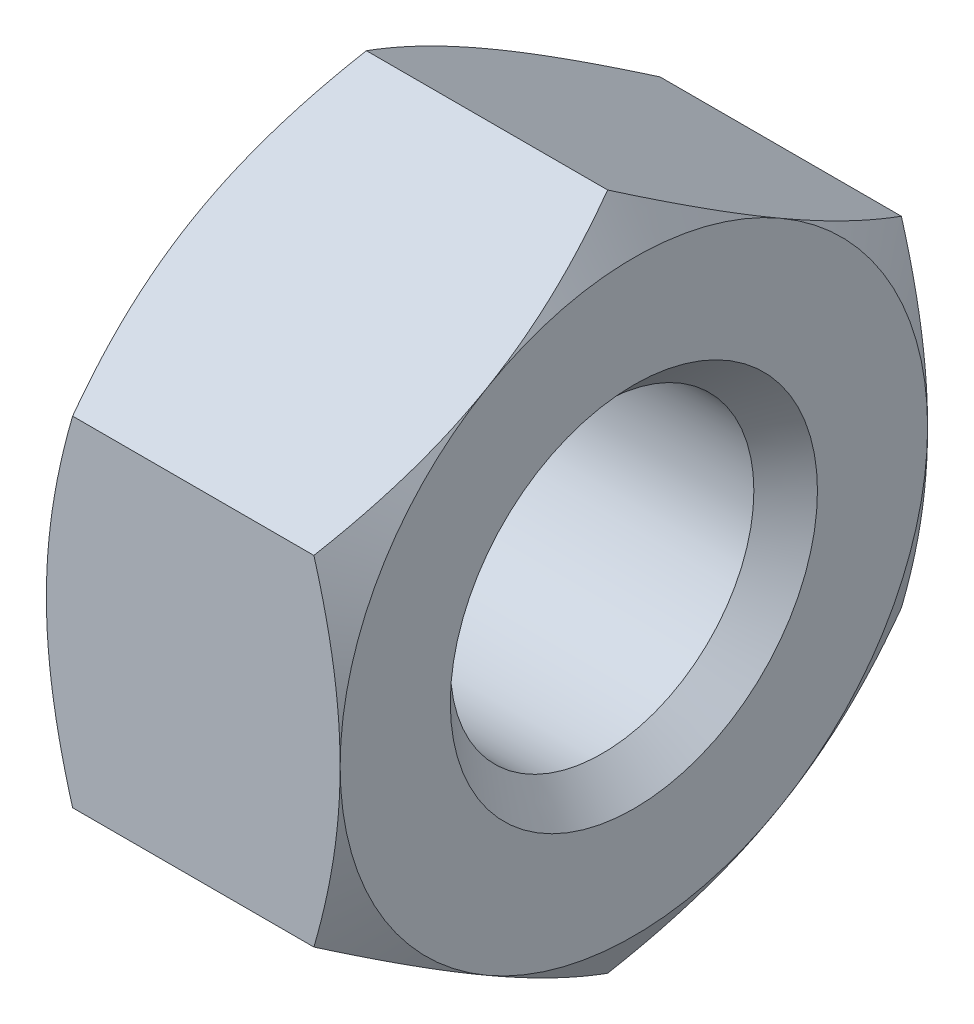
ISO-10303-21;
HEADER;
FILE_DESCRIPTION(('STEP AP214'),'2;1');
FILE_NAME('part.step','',(''),(''),'','','');
FILE_SCHEMA(('AUTOMOTIVE_DESIGN { 1 0 10303 214 1 1 1 1 }'));
ENDSEC;
DATA;
#1=APPLICATION_CONTEXT('core data for automotive mechanical design processes');
#2=APPLICATION_PROTOCOL_DEFINITION('international standard','automotive_design',2000,#1);
#3=PRODUCT_CONTEXT('',#1,'mechanical');
#4=PRODUCT('Part','Part','',(#3));
#5=PRODUCT_RELATED_PRODUCT_CATEGORY('part','',(#4));
#6=PRODUCT_DEFINITION_FORMATION('','',#4);
#7=PRODUCT_DEFINITION_CONTEXT('part definition',#1,'design');
#8=PRODUCT_DEFINITION('design','',#6,#7);
#9=PRODUCT_DEFINITION_SHAPE('','',#8);
#10=(LENGTH_UNIT() NAMED_UNIT(*) SI_UNIT(.MILLI.,.METRE.));
#11=(NAMED_UNIT(*) PLANE_ANGLE_UNIT() SI_UNIT($,.RADIAN.));
#12=(NAMED_UNIT(*) SI_UNIT($,.STERADIAN.) SOLID_ANGLE_UNIT());
#13=UNCERTAINTY_MEASURE_WITH_UNIT(LENGTH_MEASURE(1.E-05),#10,'distance_accuracy_value','');
#14=(GEOMETRIC_REPRESENTATION_CONTEXT(3) GLOBAL_UNCERTAINTY_ASSIGNED_CONTEXT((#13)) GLOBAL_UNIT_ASSIGNED_CONTEXT((#10,
#11,#12)) REPRESENTATION_CONTEXT('',''));
#15=CARTESIAN_POINT('',(0.,0.,0.));
#16=DIRECTION('',(0.,0.,1.));
#17=DIRECTION('',(1.,0.,0.));
#18=AXIS2_PLACEMENT_3D('',#15,#16,#17);
#19=CARTESIAN_POINT('',(0.,0.,0.));
#20=DIRECTION('',(1.,0.,0.));
#21=DIRECTION('',(0.,0.,1.));
#22=AXIS2_PLACEMENT_3D('',#19,#20,#21);
#23=CONICAL_SURFACE('',#22,4.,1.0471975511966);
#24=CARTESIAN_POINT('',(0.357266256575081,4.61880330821755,1.99999999888977E-06));
#25=CARTESIAN_POINT('',(0.298657292071254,4.51731909764557,-0.17577380887667));
#26=CARTESIAN_POINT('',(0.245355497856661,4.4149588768546,-0.353066911960606));
#27=CARTESIAN_POINT('',(0.152318797743035,4.20846613493174,-0.710722832365203));
#28=CARTESIAN_POINT('',(0.112616801142601,4.10432994600602,-0.891092002491144));
#29=CARTESIAN_POINT('',(0.0508177548489509,3.89734807632659,-1.2495951170215));
#30=CARTESIAN_POINT('',(0.0283093507401658,3.79453423354484,-1.4276739164409));
#31=CARTESIAN_POINT('',(0.00144399311373486,3.58842302498515,-1.78466900167571));
#32=CARTESIAN_POINT('',(-0.00293521253205977,3.48512640785602,-1.96358399079337));
#33=CARTESIAN_POINT('',(0.00619808923008943,3.29212760794636,-2.29786771803671));
#34=CARTESIAN_POINT('',(0.0174680682685131,3.20239646475493,-2.4532866170655));
#35=CARTESIAN_POINT('',(0.053180129337651,3.02351874775929,-2.76311191124388));
#36=CARTESIAN_POINT('',(0.0776343987077915,2.93437279218783,-2.91751723558292));
#37=CARTESIAN_POINT('',(0.138765364665782,2.7551265674533,-3.22798080388804));
#38=CARTESIAN_POINT('',(0.175701071632099,2.66504897298206,-3.38399977413581));
#39=CARTESIAN_POINT('',(0.259529521182041,2.4862369061122,-3.69371135896082));
#40=CARTESIAN_POINT('',(0.30640257994092,2.39750014467494,-3.84740793826927));
#41=CARTESIAN_POINT('',(0.35726625657508,2.30939992205797,-4.000002));
#42=B_SPLINE_CURVE_WITH_KNOTS('',3,(#24,#25,#26,#27,#28,#29,#30,#31,#32,#33,#34,#35,#36,#37,#38,
#39,#40,#41),.UNSPECIFIED.,.F.,.F.,(4,2,2,2,2,2,2,2,4),(0.,0.634032181234025,1.26958795462496,
1.88941567588753,2.50848238266276,3.04741719213437,3.58685104031437,4.1382469778288,
4.68856075235001),.UNSPECIFIED.);
#43=CARTESIAN_POINT('',(0.,3.46410161513775,-2.));
#44=VERTEX_POINT('',#43);
#45=CARTESIAN_POINT('',(0.357265589908163,2.3094010767585,-4.));
#46=VERTEX_POINT('',#45);
#47=EDGE_CURVE('E223',#44,#46,#42,.T.);
#48=ORIENTED_EDGE('',*,*,#47,.T.);
#49=CARTESIAN_POINT('',(1.91415319023748,6.12496791328576,-4.));
#50=CARTESIAN_POINT('',(1.82928188046009,5.94934454674692,-4.));
#51=CARTESIAN_POINT('',(1.74525423234508,5.77330595944165,-4.));
#52=CARTESIAN_POINT('',(1.57936835460172,5.42017383412661,-4.));
#53=CARTESIAN_POINT('',(1.49751050056147,5.24308011989033,-4.));
#54=CARTESIAN_POINT('',(1.33601509539964,4.88665663294971,-4.));
#55=CARTESIAN_POINT('',(1.25639292996096,4.70731986372955,-4.));
#56=CARTESIAN_POINT('',(1.10056842575945,4.34717236999863,-4.));
#57=CARTESIAN_POINT('',(1.02436590874491,4.16636172289676,-4.));
#58=CARTESIAN_POINT('',(0.875385174541292,3.80073383205831,-4.));
#59=CARTESIAN_POINT('',(0.802660495670861,3.61589465300084,-4.));
#60=CARTESIAN_POINT('',(0.662906680302123,3.24403613492685,-4.));
#61=CARTESIAN_POINT('',(0.595878177461808,3.05701655598148,-4.));
#62=CARTESIAN_POINT('',(0.469317681556576,2.68088378597247,-4.));
#63=CARTESIAN_POINT('',(0.409769751778633,2.49177601262329,-4.));
#64=CARTESIAN_POINT('',(0.300104263766313,2.11087204671964,-4.));
#65=CARTESIAN_POINT('',(0.249983723410642,1.91907672500189,-4.));
#66=CARTESIAN_POINT('',(0.161606179599127,1.53266670507117,-4.));
#67=CARTESIAN_POINT('',(0.12335232985726,1.3380512717393,-4.));
#68=CARTESIAN_POINT('',(0.0612837042111803,0.946473904052723,-4.));
#69=CARTESIAN_POINT('',(0.0374689409672342,0.749511967640737,-4.));
#70=CARTESIAN_POINT('',(0.0063852598905973,0.355519691096354,-4.));
#71=CARTESIAN_POINT('',(-0.000988416177660889,0.158497830861485,-4.));
#72=CARTESIAN_POINT('',(0.00120185676655597,-0.23540808723872,-4.));
#73=CARTESIAN_POINT('',(0.0107614086185327,-0.432292167601185,-4.));
#74=CARTESIAN_POINT('',(0.0408718597165424,-0.76849724477752,-4.));
#75=CARTESIAN_POINT('',(0.0575009490345317,-0.908189149006597,-4.));
#76=CARTESIAN_POINT('',(0.0982020119049962,-1.18649394400598,-4.));
#77=CARTESIAN_POINT('',(0.122275159198731,-1.32510666107962,-4.));
#78=CARTESIAN_POINT('',(0.20439728470357,-1.73921300262621,-4.));
#79=CARTESIAN_POINT('',(0.272327804475224,-2.01276564710678,-4.));
#80=CARTESIAN_POINT('',(0.389490408321358,-2.4220957629485,-4.));
#81=CARTESIAN_POINT('',(0.431686387730949,-2.56000684474927,-4.));
#82=CARTESIAN_POINT('',(0.520253865037997,-2.83438958957609,-4.));
#83=CARTESIAN_POINT('',(0.566622483018704,-2.97086217385934,-4.));
#84=CARTESIAN_POINT('',(0.662570371320853,-3.24179724020976,-4.));
#85=CARTESIAN_POINT('',(0.712130101245038,-3.37626671271993,-4.));
#86=CARTESIAN_POINT('',(0.814158580056113,-3.64416233700232,-4.));
#87=CARTESIAN_POINT('',(0.866628504588587,-3.77758804191473,-4.));
#88=CARTESIAN_POINT('',(0.920266349538454,-3.91053130066118,-4.));
#89=B_SPLINE_CURVE_WITH_KNOTS('',3,(#49,#50,#51,#52,#53,#54,#55,#56,#57,#58,#59,#60,#61,#62,#63,
#64,#65,#66,#67,#68,#69,#70,#71,#72,#73,#74,#75,#76,#77,#78,#79,#80,#81,#82,#83,#84,#85,#86,#87,
#88),.UNSPECIFIED.,.F.,.F.,(4,2,2,2,2,2,2,2,2,2,2,2,2,2,2,2,2,2,2,4),(0.,0.585174800843114,
1.17045024170061,1.7590748100038,2.34766866009096,2.94349007578714,3.53937768573826,
4.13397346685478,4.72838084483344,5.32294605856348,5.91751179361064,6.50827815512904,
7.09889113102511,7.52071973285857,7.94261488042752,8.78703304772405,9.21966451857854,
9.65199964840548,10.0819013472715,10.5119779988031),.UNSPECIFIED.);
#90=CARTESIAN_POINT('',(0.,0.,-4.));
#91=VERTEX_POINT('',#90);
#92=EDGE_CURVE('E119',#46,#91,#89,.T.);
#93=ORIENTED_EDGE('',*,*,#92,.T.);
#94=CARTESIAN_POINT('',(0.,0.,0.));
#95=DIRECTION('',(-1.,0.,0.));
#96=DIRECTION('',(0.,0.,-1.));
#97=AXIS2_PLACEMENT_3D('',#94,#95,#96);
#98=CIRCLE('',#97,4.);
#99=EDGE_CURVE('E257',#44,#91,#98,.T.);
#100=ORIENTED_EDGE('',*,*,#99,.F.);
#101=EDGE_LOOP('',(#48,#93,#100));
#102=FACE_BOUND('',#101,.T.);
#103=ADVANCED_FACE('F16',(#102),#23,.T.);
#104=CARTESIAN_POINT('',(0.,-3.46410161513775,-2.));
#105=VERTEX_POINT('',#104);
#106=EDGE_CURVE('E249',#91,#105,#98,.T.);
#107=ORIENTED_EDGE('',*,*,#106,.F.);
#108=CARTESIAN_POINT('',(0.357265589908163,-2.30940107675851,-4.));
#109=VERTEX_POINT('',#108);
#110=EDGE_CURVE('E217',#91,#109,#89,.T.);
#111=ORIENTED_EDGE('',*,*,#110,.T.);
#112=CARTESIAN_POINT('',(0.357266256575081,-2.30939992205797,-4.000002));
#113=CARTESIAN_POINT('',(0.298657292071257,-2.41088413262994,-3.82422619112333));
#114=CARTESIAN_POINT('',(0.245355497856665,-2.51324435342091,-3.64693308803939));
#115=CARTESIAN_POINT('',(0.15231879774304,-2.71973709534377,-3.2892771676348));
#116=CARTESIAN_POINT('',(0.112616801142606,-2.82387328426949,-3.10890799750886));
#117=CARTESIAN_POINT('',(0.0508177548489556,-3.03085515394892,-2.75040488297849));
#118=CARTESIAN_POINT('',(0.0283093507401709,-3.13366899673067,-2.5723260835591));
#119=CARTESIAN_POINT('',(0.00144399311373783,-3.33978020529036,-2.21533099832428));
#120=CARTESIAN_POINT('',(-0.00293521253205941,-3.44307682241949,-2.03641600920663));
#121=CARTESIAN_POINT('',(0.00619808923009008,-3.63607562232915,-1.70213228196329));
#122=CARTESIAN_POINT('',(0.017468068268516,-3.72580676552058,-1.5467133829345));
#123=CARTESIAN_POINT('',(0.053180129337656,-3.90468448251622,-1.23688808875612));
#124=CARTESIAN_POINT('',(0.0776343987077963,-3.99383043808768,-1.08248276441708));
#125=CARTESIAN_POINT('',(0.138765364665786,-4.17307666282221,-0.772019196111962));
#126=CARTESIAN_POINT('',(0.175701071632104,-4.26315425729345,-0.61600022586419));
#127=CARTESIAN_POINT('',(0.259529521182044,-4.44196632416331,-0.306288641039182));
#128=CARTESIAN_POINT('',(0.306402579940923,-4.53070308560058,-0.152592061730728));
#129=CARTESIAN_POINT('',(0.357266256575081,-4.61880330821755,2.00000000027992E-06));
#130=B_SPLINE_CURVE_WITH_KNOTS('',3,(#112,#113,#114,#115,#116,#117,#118,#119,#120,#121,#122,
#123,#124,#125,#126,#127,#128,#129),.UNSPECIFIED.,.F.,.F.,(4,2,2,2,2,2,2,2,4),(0.,
0.634032181234024,1.26958795462496,1.88941567588753,2.50848238266275,3.04741719213436,
3.58685104031437,4.1382469778288,4.68856075235001),.UNSPECIFIED.);
#131=EDGE_CURVE('E211',#109,#105,#130,.T.);
#132=ORIENTED_EDGE('',*,*,#131,.T.);
#133=EDGE_LOOP('',(#107,#111,#132));
#134=FACE_BOUND('',#133,.T.);
#135=ADVANCED_FACE('F246',(#134),#23,.T.);
#136=CARTESIAN_POINT('',(0.,-3.46410161513775,2.));
#137=VERTEX_POINT('',#136);
#138=EDGE_CURVE('E255',#105,#137,#98,.T.);
#139=ORIENTED_EDGE('',*,*,#138,.F.);
#140=CARTESIAN_POINT('',(0.357265589908163,-4.61880215351701,0.));
#141=VERTEX_POINT('',#140);
#142=EDGE_CURVE('E203',#105,#141,#130,.T.);
#143=ORIENTED_EDGE('',*,*,#142,.T.);
#144=CARTESIAN_POINT('',(0.35726625657508,-4.61880330821754,-1.99999999971719E-06));
#145=CARTESIAN_POINT('',(0.298657292071255,-4.51731909764557,0.175773808876672));
#146=CARTESIAN_POINT('',(0.245355497856662,-4.4149588768546,0.353066911960608));
#147=CARTESIAN_POINT('',(0.152318797743036,-4.20846613493174,0.710722832365204));
#148=CARTESIAN_POINT('',(0.112616801142602,-4.10432994600602,0.891092002491144));
#149=CARTESIAN_POINT('',(0.0508177548489518,-3.8973480763266,1.2495951170215));
#150=CARTESIAN_POINT('',(0.0283093507401669,-3.79453423354484,1.4276739164409));
#151=CARTESIAN_POINT('',(0.00144399311373521,-3.58842302498515,1.78466900167571));
#152=CARTESIAN_POINT('',(-0.00293521253206031,-3.48512640785602,1.96358399079336));
#153=CARTESIAN_POINT('',(0.00619808923008891,-3.29212760794636,2.29786771803671));
#154=CARTESIAN_POINT('',(0.0174680682685134,-3.20239646475493,2.45328661706549));
#155=CARTESIAN_POINT('',(0.053180129337652,-3.02351874775929,2.76311191124388));
#156=CARTESIAN_POINT('',(0.0776343987077924,-2.93437279218783,2.91751723558292));
#157=CARTESIAN_POINT('',(0.138765364665783,-2.7551265674533,3.22798080388804));
#158=CARTESIAN_POINT('',(0.1757010716321,-2.66504897298206,3.38399977413581));
#159=CARTESIAN_POINT('',(0.259529521182041,-2.4862369061122,3.69371135896082));
#160=CARTESIAN_POINT('',(0.306402579940921,-2.39750014467494,3.84740793826927));
#161=CARTESIAN_POINT('',(0.357266256575081,-2.30939992205796,4.000002));
#162=B_SPLINE_CURVE_WITH_KNOTS('',3,(#144,#145,#146,#147,#148,#149,#150,#151,#152,#153,#154,
#155,#156,#157,#158,#159,#160,#161),.UNSPECIFIED.,.F.,.F.,(4,2,2,2,2,2,2,2,4),(0.,
0.634032181234022,1.26958795462496,1.88941567588752,2.50848238266275,3.04741719213436,
3.58685104031437,4.1382469778288,4.68856075235001),.UNSPECIFIED.);
#163=EDGE_CURVE('E537',#141,#137,#162,.T.);
#164=ORIENTED_EDGE('',*,*,#163,.T.);
#165=EDGE_LOOP('',(#139,#143,#164));
#166=FACE_BOUND('',#165,.T.);
#167=ADVANCED_FACE('F337',(#166),#23,.T.);
#168=CARTESIAN_POINT('',(0.357266256575081,2.30939992205797,4.000002));
#169=CARTESIAN_POINT('',(0.298657292071257,2.41088413262994,3.82422619112333));
#170=CARTESIAN_POINT('',(0.245355497856665,2.51324435342091,3.64693308803939));
#171=CARTESIAN_POINT('',(0.152318797743039,2.71973709534377,3.2892771676348));
#172=CARTESIAN_POINT('',(0.112616801142605,2.82387328426949,3.10890799750886));
#173=CARTESIAN_POINT('',(0.0508177548489544,3.03085515394892,2.75040488297849));
#174=CARTESIAN_POINT('',(0.0283093507401701,3.13366899673067,2.5723260835591));
#175=CARTESIAN_POINT('',(0.00144399311373757,3.33978020529036,2.21533099832428));
#176=CARTESIAN_POINT('',(-0.00293521253205961,3.44307682241949,2.03641600920663));
#177=CARTESIAN_POINT('',(0.00619808923008974,3.63607562232915,1.70213228196329));
#178=CARTESIAN_POINT('',(0.0174680682685156,3.72580676552058,1.5467133829345));
#179=CARTESIAN_POINT('',(0.0531801293376553,3.90468448251622,1.23688808875612));
#180=CARTESIAN_POINT('',(0.0776343987077955,3.99383043808768,1.08248276441708));
#181=CARTESIAN_POINT('',(0.138765364665786,4.17307666282221,0.772019196111961));
#182=CARTESIAN_POINT('',(0.175701071632103,4.26315425729345,0.616000225864189));
#183=CARTESIAN_POINT('',(0.259529521182044,4.44196632416331,0.306288641039181));
#184=CARTESIAN_POINT('',(0.306402579940922,4.53070308560057,0.152592061730727));
#185=CARTESIAN_POINT('',(0.35726625657508,4.61880330821755,-2.00000000084571E-06));
#186=B_SPLINE_CURVE_WITH_KNOTS('',3,(#168,#169,#170,#171,#172,#173,#174,#175,#176,#177,#178,
#179,#180,#181,#182,#183,#184,#185),.UNSPECIFIED.,.F.,.F.,(4,2,2,2,2,2,2,2,4),(0.,
0.634032181234024,1.26958795462496,1.88941567588753,2.50848238266275,3.04741719213436,
3.58685104031437,4.1382469778288,4.68856075235001),.UNSPECIFIED.);
#187=CARTESIAN_POINT('',(0.,3.46410161513775,2.));
#188=VERTEX_POINT('',#187);
#189=CARTESIAN_POINT('',(0.357265589908163,4.61880215351701,0.));
#190=VERTEX_POINT('',#189);
#191=EDGE_CURVE('E364',#188,#190,#186,.T.);
#192=ORIENTED_EDGE('',*,*,#191,.T.);
#193=EDGE_CURVE('E212',#190,#44,#42,.T.);
#194=ORIENTED_EDGE('',*,*,#193,.T.);
#195=EDGE_CURVE('E266',#188,#44,#98,.T.);
#196=ORIENTED_EDGE('',*,*,#195,.F.);
#197=EDGE_LOOP('',(#192,#194,#196));
#198=FACE_BOUND('',#197,.T.);
#199=ADVANCED_FACE('F345',(#198),#23,.T.);
#200=CARTESIAN_POINT('',(0.,0.,4.));
#201=VERTEX_POINT('',#200);
#202=EDGE_CURVE('E263',#137,#201,#98,.T.);
#203=ORIENTED_EDGE('',*,*,#202,.F.);
#204=CARTESIAN_POINT('',(0.357265589908163,-2.3094010767585,4.));
#205=VERTEX_POINT('',#204);
#206=EDGE_CURVE('E38',#137,#205,#162,.T.);
#207=ORIENTED_EDGE('',*,*,#206,.T.);
#208=CARTESIAN_POINT('',(1.91415319023748,6.12496791328576,4.));
#209=CARTESIAN_POINT('',(1.82928188046009,5.94934454674692,4.));
#210=CARTESIAN_POINT('',(1.74525423234508,5.77330595944165,4.));
#211=CARTESIAN_POINT('',(1.57936835460172,5.42017383412661,4.));
#212=CARTESIAN_POINT('',(1.49751050056147,5.24308011989033,4.));
#213=CARTESIAN_POINT('',(1.33601509539964,4.88665663294971,4.));
#214=CARTESIAN_POINT('',(1.25639292996096,4.70731986372955,4.));
#215=CARTESIAN_POINT('',(1.10056842575945,4.34717236999863,4.));
#216=CARTESIAN_POINT('',(1.02436590874491,4.16636172289676,4.));
#217=CARTESIAN_POINT('',(0.875385174541293,3.80073383205831,4.));
#218=CARTESIAN_POINT('',(0.802660495670861,3.61589465300084,4.));
#219=CARTESIAN_POINT('',(0.662906680302123,3.24403613492686,4.));
#220=CARTESIAN_POINT('',(0.595878177461809,3.05701655598148,4.));
#221=CARTESIAN_POINT('',(0.469317681556577,2.68088378597247,4.));
#222=CARTESIAN_POINT('',(0.409769751778633,2.49177601262329,4.));
#223=CARTESIAN_POINT('',(0.300104263766314,2.11087204671965,4.));
#224=CARTESIAN_POINT('',(0.249983723410642,1.91907672500189,4.));
#225=CARTESIAN_POINT('',(0.161606179599127,1.53266670507117,4.));
#226=CARTESIAN_POINT('',(0.123352329857261,1.33805127173931,4.));
#227=CARTESIAN_POINT('',(0.0612837042111813,0.946473904052728,4.));
#228=CARTESIAN_POINT('',(0.0374689409672346,0.749511967640741,4.));
#229=CARTESIAN_POINT('',(0.00638525989059737,0.355519691096358,4.));
#230=CARTESIAN_POINT('',(-0.000988416177660533,0.15849783086149,4.));
#231=CARTESIAN_POINT('',(0.00120185676655661,-0.235408087238715,4.));
#232=CARTESIAN_POINT('',(0.0107614086185334,-0.432292167601181,4.));
#233=CARTESIAN_POINT('',(0.0408718597165428,-0.768497244777516,4.));
#234=CARTESIAN_POINT('',(0.0575009490345318,-0.908189149006593,4.));
#235=CARTESIAN_POINT('',(0.0982020119049962,-1.18649394400598,4.));
#236=CARTESIAN_POINT('',(0.122275159198731,-1.32510666107962,4.));
#237=CARTESIAN_POINT('',(0.20439728470357,-1.7392130026262,4.));
#238=CARTESIAN_POINT('',(0.272327804475224,-2.01276564710678,4.));
#239=CARTESIAN_POINT('',(0.38949040832136,-2.42209576294849,4.));
#240=CARTESIAN_POINT('',(0.431686387730951,-2.56000684474927,4.));
#241=CARTESIAN_POINT('',(0.520253865037999,-2.83438958957609,4.));
#242=CARTESIAN_POINT('',(0.566622483018705,-2.97086217385934,4.));
#243=CARTESIAN_POINT('',(0.662570371320854,-3.24179724020976,4.));
#244=CARTESIAN_POINT('',(0.712130101245039,-3.37626671271993,4.));
#245=CARTESIAN_POINT('',(0.814158580056115,-3.64416233700232,4.));
#246=CARTESIAN_POINT('',(0.866628504588589,-3.77758804191473,4.));
#247=CARTESIAN_POINT('',(0.920266349538457,-3.91053130066118,4.));
#248=B_SPLINE_CURVE_WITH_KNOTS('',3,(#208,#209,#210,#211,#212,#213,#214,#215,#216,#217,#218,
#219,#220,#221,#222,#223,#224,#225,#226,#227,#228,#229,#230,#231,#232,#233,#234,#235,#236,#237,
#238,#239,#240,#241,#242,#243,#244,#245,#246,#247),.UNSPECIFIED.,.F.,.F.,(4,2,2,2,2,2,2,2,2,2,2,
2,2,2,2,2,2,2,2,4),(0.,0.585174800843114,1.17045024170061,1.7590748100038,2.34766866009095,
2.94349007578714,3.53937768573826,4.13397346685478,4.72838084483343,5.32294605856347,
5.91751179361063,6.50827815512903,7.09889113102511,7.52071973285856,7.94261488042752,
8.78703304772405,9.21966451857854,9.65199964840548,10.0819013472715,10.5119779988031),.UNSPECIFIED.);
#249=EDGE_CURVE('E11',#205,#201,#248,.F.);
#250=ORIENTED_EDGE('',*,*,#249,.T.);
#251=EDGE_LOOP('',(#203,#207,#250));
#252=FACE_BOUND('',#251,.T.);
#253=ADVANCED_FACE('F340',(#252),#23,.T.);
#254=CARTESIAN_POINT('',(0.357265589908163,2.30940107675851,4.));
#255=VERTEX_POINT('',#254);
#256=EDGE_CURVE('E21',#201,#255,#248,.F.);
#257=ORIENTED_EDGE('',*,*,#256,.T.);
#258=EDGE_CURVE('E126',#255,#188,#186,.T.);
#259=ORIENTED_EDGE('',*,*,#258,.T.);
#260=EDGE_CURVE('E273',#201,#188,#98,.T.);
#261=ORIENTED_EDGE('',*,*,#260,.F.);
#262=EDGE_LOOP('',(#257,#259,#261));
#263=FACE_BOUND('',#262,.T.);
#264=ADVANCED_FACE('F153',(#263),#23,.T.);
#265=CARTESIAN_POINT('',(3.64204283310244,0.,0.));
#266=DIRECTION('',(-1.,0.,0.));
#267=DIRECTION('',(0.,0.,-1.));
#268=AXIS2_PLACEMENT_3D('',#265,#266,#267);
#269=CONICAL_SURFACE('',#268,4.62,1.0471975511966);
#270=CARTESIAN_POINT('',(2.08584680976251,6.12496791328576,4.));
#271=CARTESIAN_POINT('',(2.17071811953991,5.94934454674692,4.));
#272=CARTESIAN_POINT('',(2.25474576765492,5.77330595944165,4.));
#273=CARTESIAN_POINT('',(2.42063164539828,5.42017383412661,4.));
#274=CARTESIAN_POINT('',(2.50248949943853,5.24308011989033,4.));
#275=CARTESIAN_POINT('',(2.66398490460037,4.88665663294972,4.));
#276=CARTESIAN_POINT('',(2.74360707003904,4.70731986372955,4.));
#277=CARTESIAN_POINT('',(2.89943157424055,4.34717236999863,4.));
#278=CARTESIAN_POINT('',(2.97563409125509,4.16636172289676,4.));
#279=CARTESIAN_POINT('',(3.12461482545871,3.80073383205831,4.));
#280=CARTESIAN_POINT('',(3.19733950432914,3.61589465300085,4.));
#281=CARTESIAN_POINT('',(3.33709331969788,3.24403613492686,4.));
#282=CARTESIAN_POINT('',(3.40412182253819,3.05701655598148,4.));
#283=CARTESIAN_POINT('',(3.53068231844343,2.68088378597248,4.));
#284=CARTESIAN_POINT('',(3.59023024822137,2.4917760126233,4.));
#285=CARTESIAN_POINT('',(3.69989573623369,2.11087204671965,4.));
#286=CARTESIAN_POINT('',(3.75001627658936,1.9190767250019,4.));
#287=CARTESIAN_POINT('',(3.83839382040087,1.53266670507118,4.));
#288=CARTESIAN_POINT('',(3.87664767014274,1.33805127173931,4.));
#289=CARTESIAN_POINT('',(3.93871629578882,0.946473904052731,4.));
#290=CARTESIAN_POINT('',(3.96253105903277,0.749511967640745,4.));
#291=CARTESIAN_POINT('',(3.9936147401094,0.35551969109636,4.));
#292=CARTESIAN_POINT('',(4.00098841617766,0.158497830861491,4.));
#293=CARTESIAN_POINT('',(3.99879814323345,-0.235408087238714,4.));
#294=CARTESIAN_POINT('',(3.98923859138147,-0.43229216760118,4.));
#295=CARTESIAN_POINT('',(3.95912814028346,-0.768497244777516,4.));
#296=CARTESIAN_POINT('',(3.94249905096547,-0.908189149006594,4.));
#297=CARTESIAN_POINT('',(3.90179798809501,-1.18649394400598,4.));
#298=CARTESIAN_POINT('',(3.87772484080127,-1.32510666107962,4.));
#299=CARTESIAN_POINT('',(3.79560271529643,-1.73921300262621,4.));
#300=CARTESIAN_POINT('',(3.72767219552478,-2.01276564710678,4.));
#301=CARTESIAN_POINT('',(3.61050959167864,-2.4220957629485,4.));
#302=CARTESIAN_POINT('',(3.56831361226905,-2.56000684474927,4.));
#303=CARTESIAN_POINT('',(3.479746134962,-2.83438958957609,4.));
#304=CARTESIAN_POINT('',(3.4333775169813,-2.97086217385934,4.));
#305=CARTESIAN_POINT('',(3.33742962867915,-3.24179724020976,4.));
#306=CARTESIAN_POINT('',(3.28786989875496,-3.37626671271993,4.));
#307=CARTESIAN_POINT('',(3.18584141994389,-3.64416233700232,4.));
#308=CARTESIAN_POINT('',(3.13337149541141,-3.77758804191473,4.));
#309=CARTESIAN_POINT('',(3.07973365046154,-3.91053130066118,4.));
#310=B_SPLINE_CURVE_WITH_KNOTS('',3,(#270,#271,#272,#273,#274,#275,#276,#277,#278,#279,#280,
#281,#282,#283,#284,#285,#286,#287,#288,#289,#290,#291,#292,#293,#294,#295,#296,#297,#298,#299,
#300,#301,#302,#303,#304,#305,#306,#307,#308,#309),.UNSPECIFIED.,.F.,.F.,(4,2,2,2,2,2,2,2,2,2,2,
2,2,2,2,2,2,2,2,4),(0.,0.585174800843114,1.17045024170061,1.7590748100038,2.34766866009095,
2.94349007578714,3.53937768573825,4.13397346685478,4.72838084483343,5.32294605856347,
5.91751179361063,6.50827815512903,7.09889113102511,7.52071973285857,7.94261488042752,
8.78703304772405,9.21966451857854,9.65199964840548,10.0819013472715,10.5119779988031),.UNSPECIFIED.);
#311=CARTESIAN_POINT('',(4.,0.,4.));
#312=VERTEX_POINT('',#311);
#313=CARTESIAN_POINT('',(3.64273441009184,-2.3094010767585,4.));
#314=VERTEX_POINT('',#313);
#315=EDGE_CURVE('E115',#312,#314,#310,.T.);
#316=ORIENTED_EDGE('',*,*,#315,.T.);
#317=CARTESIAN_POINT('',(3.64273374342492,-2.30939992205796,4.000002));
#318=CARTESIAN_POINT('',(3.70134270792875,-2.41088413262993,3.82422619112333));
#319=CARTESIAN_POINT('',(3.75464450214334,-2.51324435342091,3.64693308803939));
#320=CARTESIAN_POINT('',(3.84768120225697,-2.71973709534376,3.2892771676348));
#321=CARTESIAN_POINT('',(3.8873831988574,-2.82387328426948,3.10890799750886));
#322=CARTESIAN_POINT('',(3.94918224515105,-3.03085515394891,2.7504048829785));
#323=CARTESIAN_POINT('',(3.97169064925984,-3.13366899673066,2.5723260835591));
#324=CARTESIAN_POINT('',(3.99855600688627,-3.33978020529035,2.21533099832429));
#325=CARTESIAN_POINT('',(4.00293521253206,-3.44307682241949,2.03641600920664));
#326=CARTESIAN_POINT('',(3.99380191076991,-3.63607562232915,1.70213228196329));
#327=CARTESIAN_POINT('',(3.98253193173149,-3.72580676552057,1.54671338293451));
#328=CARTESIAN_POINT('',(3.94681987066235,-3.90468448251621,1.23688808875612));
#329=CARTESIAN_POINT('',(3.92236560129221,-3.99383043808767,1.08248276441708));
#330=CARTESIAN_POINT('',(3.86123463533422,-4.1730766628222,0.772019196111963));
#331=CARTESIAN_POINT('',(3.8242989283679,-4.26315425729344,0.616000225864192));
#332=CARTESIAN_POINT('',(3.74047047881796,-4.44196632416331,0.306288641039184));
#333=CARTESIAN_POINT('',(3.69359742005908,-4.53070308560057,0.152592061730729));
#334=CARTESIAN_POINT('',(3.64273374342492,-4.61880330821754,-1.99999999928062E-06));
#335=B_SPLINE_CURVE_WITH_KNOTS('',3,(#317,#318,#319,#320,#321,#322,#323,#324,#325,#326,#327,
#328,#329,#330,#331,#332,#333,#334),.UNSPECIFIED.,.F.,.F.,(4,2,2,2,2,2,2,2,4),(0.,
0.634032181234024,1.26958795462496,1.88941567588752,2.50848238266275,3.04741719213436,
3.58685104031437,4.1382469778288,4.68856075235001),.UNSPECIFIED.);
#336=CARTESIAN_POINT('',(4.,-3.46410161513775,2.));
#337=VERTEX_POINT('',#336);
#338=EDGE_CURVE('E121',#314,#337,#335,.T.);
#339=ORIENTED_EDGE('',*,*,#338,.T.);
#340=CARTESIAN_POINT('',(4.,0.,0.));
#341=DIRECTION('',(-1.,0.,0.));
#342=DIRECTION('',(0.,0.,-1.));
#343=AXIS2_PLACEMENT_3D('',#340,#341,#342);
#344=CIRCLE('',#343,4.);
#345=EDGE_CURVE('E129',#337,#312,#344,.T.);
#346=ORIENTED_EDGE('',*,*,#345,.T.);
#347=EDGE_LOOP('',(#316,#339,#346));
#348=FACE_BOUND('',#347,.T.);
#349=ADVANCED_FACE('F128',(#348),#269,.T.);
#350=CARTESIAN_POINT('',(4.,-3.46410161513775,-2.));
#351=VERTEX_POINT('',#350);
#352=EDGE_CURVE('E276',#351,#337,#344,.T.);
#353=ORIENTED_EDGE('',*,*,#352,.T.);
#354=CARTESIAN_POINT('',(3.64273441009184,-4.61880215351701,0.));
#355=VERTEX_POINT('',#354);
#356=EDGE_CURVE('E45',#337,#355,#335,.T.);
#357=ORIENTED_EDGE('',*,*,#356,.T.);
#358=CARTESIAN_POINT('',(3.64273374342492,-4.61880330821755,2.00000000035356E-06));
#359=CARTESIAN_POINT('',(3.70134270792874,-4.51731909764558,-0.175773808876672));
#360=CARTESIAN_POINT('',(3.75464450214334,-4.4149588768546,-0.353066911960608));
#361=CARTESIAN_POINT('',(3.84768120225696,-4.20846613493175,-0.710722832365204));
#362=CARTESIAN_POINT('',(3.8873831988574,-4.10432994600602,-0.891092002491145));
#363=CARTESIAN_POINT('',(3.94918224515105,-3.8973480763266,-1.24959511702151));
#364=CARTESIAN_POINT('',(3.97169064925983,-3.79453423354485,-1.4276739164409));
#365=CARTESIAN_POINT('',(3.99855600688626,-3.58842302498515,-1.78466900167571));
#366=CARTESIAN_POINT('',(4.00293521253206,-3.48512640785602,-1.96358399079336));
#367=CARTESIAN_POINT('',(3.99380191076991,-3.29212760794636,-2.29786771803671));
#368=CARTESIAN_POINT('',(3.98253193173149,-3.20239646475494,-2.4532866170655));
#369=CARTESIAN_POINT('',(3.94681987066235,-3.02351874775929,-2.76311191124388));
#370=CARTESIAN_POINT('',(3.92236560129221,-2.93437279218784,-2.91751723558292));
#371=CARTESIAN_POINT('',(3.86123463533422,-2.75512656745331,-3.22798080388804));
#372=CARTESIAN_POINT('',(3.8242989283679,-2.66504897298207,-3.38399977413581));
#373=CARTESIAN_POINT('',(3.74047047881796,-2.4862369061122,-3.69371135896082));
#374=CARTESIAN_POINT('',(3.69359742005908,-2.39750014467494,-3.84740793826927));
#375=CARTESIAN_POINT('',(3.64273374342492,-2.30939992205797,-4.000002));
#376=B_SPLINE_CURVE_WITH_KNOTS('',3,(#358,#359,#360,#361,#362,#363,#364,#365,#366,#367,#368,
#369,#370,#371,#372,#373,#374,#375),.UNSPECIFIED.,.F.,.F.,(4,2,2,2,2,2,2,2,4),(0.,
0.634032181234024,1.26958795462496,1.88941567588752,2.50848238266275,3.04741719213436,
3.58685104031437,4.1382469778288,4.68856075235001),.UNSPECIFIED.);
#377=EDGE_CURVE('E189',#355,#351,#376,.T.);
#378=ORIENTED_EDGE('',*,*,#377,.T.);
#379=EDGE_LOOP('',(#353,#357,#378));
#380=FACE_BOUND('',#379,.T.);
#381=ADVANCED_FACE('F152',(#380),#269,.T.);
#382=CARTESIAN_POINT('',(4.,0.,-4.));
#383=VERTEX_POINT('',#382);
#384=EDGE_CURVE('E267',#383,#351,#344,.T.);
#385=ORIENTED_EDGE('',*,*,#384,.T.);
#386=CARTESIAN_POINT('',(3.64273441009184,-2.30940107675851,-4.));
#387=VERTEX_POINT('',#386);
#388=EDGE_CURVE('E183',#351,#387,#376,.T.);
#389=ORIENTED_EDGE('',*,*,#388,.T.);
#390=CARTESIAN_POINT('',(2.08584680976251,6.12496791328576,-4.));
#391=CARTESIAN_POINT('',(2.17071811953991,5.94934454674692,-4.));
#392=CARTESIAN_POINT('',(2.25474576765492,5.77330595944165,-4.));
#393=CARTESIAN_POINT('',(2.42063164539828,5.42017383412661,-4.));
#394=CARTESIAN_POINT('',(2.50248949943853,5.24308011989033,-4.));
#395=CARTESIAN_POINT('',(2.66398490460037,4.88665663294971,-4.));
#396=CARTESIAN_POINT('',(2.74360707003904,4.70731986372955,-4.));
#397=CARTESIAN_POINT('',(2.89943157424055,4.34717236999863,-4.));
#398=CARTESIAN_POINT('',(2.97563409125509,4.16636172289676,-4.));
#399=CARTESIAN_POINT('',(3.12461482545871,3.80073383205831,-4.));
#400=CARTESIAN_POINT('',(3.19733950432914,3.61589465300084,-4.));
#401=CARTESIAN_POINT('',(3.33709331969788,3.24403613492686,-4.));
#402=CARTESIAN_POINT('',(3.40412182253819,3.05701655598148,-4.));
#403=CARTESIAN_POINT('',(3.53068231844343,2.68088378597247,-4.));
#404=CARTESIAN_POINT('',(3.59023024822137,2.49177601262329,-4.));
#405=CARTESIAN_POINT('',(3.69989573623369,2.11087204671965,-4.));
#406=CARTESIAN_POINT('',(3.75001627658936,1.91907672500189,-4.));
#407=CARTESIAN_POINT('',(3.83839382040087,1.53266670507117,-4.));
#408=CARTESIAN_POINT('',(3.87664767014274,1.33805127173931,-4.));
#409=CARTESIAN_POINT('',(3.93871629578882,0.946473904052727,-4.));
#410=CARTESIAN_POINT('',(3.96253105903277,0.749511967640741,-4.));
#411=CARTESIAN_POINT('',(3.99361474010941,0.355519691096357,-4.));
#412=CARTESIAN_POINT('',(4.00098841617766,0.158497830861489,-4.));
#413=CARTESIAN_POINT('',(3.99879814323345,-0.235408087238717,-4.));
#414=CARTESIAN_POINT('',(3.98923859138147,-0.432292167601183,-4.));
#415=CARTESIAN_POINT('',(3.95912814028346,-0.768497244777519,-4.));
#416=CARTESIAN_POINT('',(3.94249905096547,-0.908189149006597,-4.));
#417=CARTESIAN_POINT('',(3.90179798809501,-1.18649394400598,-4.));
#418=CARTESIAN_POINT('',(3.87772484080127,-1.32510666107962,-4.));
#419=CARTESIAN_POINT('',(3.79560271529643,-1.73921300262621,-4.));
#420=CARTESIAN_POINT('',(3.72767219552478,-2.01276564710678,-4.));
#421=CARTESIAN_POINT('',(3.61050959167864,-2.4220957629485,-4.));
#422=CARTESIAN_POINT('',(3.56831361226905,-2.56000684474928,-4.));
#423=CARTESIAN_POINT('',(3.479746134962,-2.8343895895761,-4.));
#424=CARTESIAN_POINT('',(3.4333775169813,-2.97086217385935,-4.));
#425=CARTESIAN_POINT('',(3.33742962867915,-3.24179724020977,-4.));
#426=CARTESIAN_POINT('',(3.28786989875496,-3.37626671271993,-4.));
#427=CARTESIAN_POINT('',(3.18584141994389,-3.64416233700232,-4.));
#428=CARTESIAN_POINT('',(3.13337149541141,-3.77758804191473,-4.));
#429=CARTESIAN_POINT('',(3.07973365046154,-3.91053130066119,-4.));
#430=B_SPLINE_CURVE_WITH_KNOTS('',3,(#390,#391,#392,#393,#394,#395,#396,#397,#398,#399,#400,
#401,#402,#403,#404,#405,#406,#407,#408,#409,#410,#411,#412,#413,#414,#415,#416,#417,#418,#419,
#420,#421,#422,#423,#424,#425,#426,#427,#428,#429),.UNSPECIFIED.,.F.,.F.,(4,2,2,2,2,2,2,2,2,2,2,
2,2,2,2,2,2,2,2,4),(0.,0.585174800843115,1.17045024170061,1.7590748100038,2.34766866009096,
2.94349007578714,3.53937768573826,4.13397346685478,4.72838084483343,5.32294605856348,
5.91751179361063,6.50827815512904,7.09889113102511,7.52071973285857,7.94261488042753,
8.78703304772406,9.21966451857855,9.65199964840549,10.0819013472715,10.5119779988031),.UNSPECIFIED.);
#431=EDGE_CURVE('E190',#387,#383,#430,.F.);
#432=ORIENTED_EDGE('',*,*,#431,.T.);
#433=EDGE_LOOP('',(#385,#389,#432));
#434=FACE_BOUND('',#433,.T.);
#435=ADVANCED_FACE('F386',(#434),#269,.T.);
#436=CARTESIAN_POINT('',(4.,3.46410161513775,-2.));
#437=VERTEX_POINT('',#436);
#438=EDGE_CURVE('E277',#437,#383,#344,.T.);
#439=ORIENTED_EDGE('',*,*,#438,.T.);
#440=CARTESIAN_POINT('',(3.64273441009184,2.3094010767585,-4.));
#441=VERTEX_POINT('',#440);
#442=EDGE_CURVE('E177',#383,#441,#430,.F.);
#443=ORIENTED_EDGE('',*,*,#442,.T.);
#444=CARTESIAN_POINT('',(3.64273374342492,2.30939992205797,-4.000002));
#445=CARTESIAN_POINT('',(3.70134270792875,2.41088413262993,-3.82422619112333));
#446=CARTESIAN_POINT('',(3.75464450214334,2.51324435342091,-3.64693308803939));
#447=CARTESIAN_POINT('',(3.84768120225697,2.71973709534376,-3.28927716763479));
#448=CARTESIAN_POINT('',(3.8873831988574,2.82387328426949,-3.10890799750885));
#449=CARTESIAN_POINT('',(3.94918224515105,3.03085515394891,-2.75040488297849));
#450=CARTESIAN_POINT('',(3.97169064925984,3.13366899673066,-2.5723260835591));
#451=CARTESIAN_POINT('',(3.99855600688627,3.33978020529035,-2.21533099832429));
#452=CARTESIAN_POINT('',(4.00293521253206,3.44307682241949,-2.03641600920664));
#453=CARTESIAN_POINT('',(3.99380191076991,3.63607562232915,-1.70213228196329));
#454=CARTESIAN_POINT('',(3.98253193173149,3.72580676552057,-1.54671338293451));
#455=CARTESIAN_POINT('',(3.94681987066235,3.90468448251622,-1.23688808875612));
#456=CARTESIAN_POINT('',(3.92236560129221,3.99383043808767,-1.08248276441708));
#457=CARTESIAN_POINT('',(3.86123463533422,4.1730766628222,-0.772019196111961));
#458=CARTESIAN_POINT('',(3.8242989283679,4.26315425729344,-0.616000225864189));
#459=CARTESIAN_POINT('',(3.74047047881796,4.44196632416331,-0.306288641039181));
#460=CARTESIAN_POINT('',(3.69359742005908,4.53070308560057,-0.152592061730727));
#461=CARTESIAN_POINT('',(3.64273374342492,4.61880330821755,1.99999999892566E-06));
#462=B_SPLINE_CURVE_WITH_KNOTS('',3,(#444,#445,#446,#447,#448,#449,#450,#451,#452,#453,#454,
#455,#456,#457,#458,#459,#460,#461),.UNSPECIFIED.,.F.,.F.,(4,2,2,2,2,2,2,2,4),(0.,
0.634032181234023,1.26958795462496,1.88941567588752,2.50848238266275,3.04741719213436,
3.58685104031437,4.1382469778288,4.68856075235001),.UNSPECIFIED.);
#463=EDGE_CURVE('E619',#441,#437,#462,.T.);
#464=ORIENTED_EDGE('',*,*,#463,.T.);
#465=EDGE_LOOP('',(#439,#443,#464));
#466=FACE_BOUND('',#465,.T.);
#467=ADVANCED_FACE('F396',(#466),#269,.T.);
#468=CARTESIAN_POINT('',(4.,3.46410161513775,2.));
#469=VERTEX_POINT('',#468);
#470=EDGE_CURVE('E287',#469,#437,#344,.T.);
#471=ORIENTED_EDGE('',*,*,#470,.T.);
#472=CARTESIAN_POINT('',(3.64273441009184,4.61880215351701,0.));
#473=VERTEX_POINT('',#472);
#474=EDGE_CURVE('E171',#437,#473,#462,.T.);
#475=ORIENTED_EDGE('',*,*,#474,.T.);
#476=CARTESIAN_POINT('',(3.64273374342492,4.61880330821755,-2.00000000111023E-06));
#477=CARTESIAN_POINT('',(3.70134270792874,4.51731909764558,0.175773808876671));
#478=CARTESIAN_POINT('',(3.75464450214334,4.4149588768546,0.353066911960607));
#479=CARTESIAN_POINT('',(3.84768120225696,4.20846613493175,0.710722832365203));
#480=CARTESIAN_POINT('',(3.8873831988574,4.10432994600602,0.891092002491144));
#481=CARTESIAN_POINT('',(3.94918224515105,3.8973480763266,1.2495951170215));
#482=CARTESIAN_POINT('',(3.97169064925983,3.79453423354485,1.4276739164409));
#483=CARTESIAN_POINT('',(3.99855600688626,3.58842302498516,1.78466900167571));
#484=CARTESIAN_POINT('',(4.00293521253206,3.48512640785602,1.96358399079336));
#485=CARTESIAN_POINT('',(3.99380191076991,3.29212760794637,2.29786771803671));
#486=CARTESIAN_POINT('',(3.98253193173149,3.20239646475494,2.45328661706549));
#487=CARTESIAN_POINT('',(3.94681987066235,3.0235187477593,2.76311191124388));
#488=CARTESIAN_POINT('',(3.92236560129221,2.93437279218784,2.91751723558292));
#489=CARTESIAN_POINT('',(3.86123463533422,2.75512656745331,3.22798080388804));
#490=CARTESIAN_POINT('',(3.8242989283679,2.66504897298207,3.38399977413581));
#491=CARTESIAN_POINT('',(3.74047047881796,2.4862369061122,3.69371135896082));
#492=CARTESIAN_POINT('',(3.69359742005908,2.39750014467494,3.84740793826927));
#493=CARTESIAN_POINT('',(3.64273374342492,2.30939992205797,4.000002));
#494=B_SPLINE_CURVE_WITH_KNOTS('',3,(#476,#477,#478,#479,#480,#481,#482,#483,#484,#485,#486,
#487,#488,#489,#490,#491,#492,#493),.UNSPECIFIED.,.F.,.F.,(4,2,2,2,2,2,2,2,4),(0.,
0.634032181234023,1.26958795462496,1.88941567588752,2.50848238266275,3.04741719213436,
3.58685104031437,4.1382469778288,4.68856075235001),.UNSPECIFIED.);
#495=EDGE_CURVE('E616',#473,#469,#494,.T.);
#496=ORIENTED_EDGE('',*,*,#495,.T.);
#497=EDGE_LOOP('',(#471,#475,#496));
#498=FACE_BOUND('',#497,.T.);
#499=ADVANCED_FACE('F330',(#498),#269,.T.);
#500=EDGE_CURVE('E298',#312,#469,#344,.T.);
#501=ORIENTED_EDGE('',*,*,#500,.T.);
#502=CARTESIAN_POINT('',(3.64273441009184,2.30940107675851,4.));
#503=VERTEX_POINT('',#502);
#504=EDGE_CURVE('E164',#469,#503,#494,.T.);
#505=ORIENTED_EDGE('',*,*,#504,.T.);
#506=EDGE_CURVE('E131',#503,#312,#310,.T.);
#507=ORIENTED_EDGE('',*,*,#506,.T.);
#508=EDGE_LOOP('',(#501,#505,#507));
#509=FACE_BOUND('',#508,.T.);
#510=ADVANCED_FACE('F154',(#509),#269,.T.);
#511=CARTESIAN_POINT('',(0.433,0.,0.));
#512=DIRECTION('',(-1.,0.,0.));
#513=DIRECTION('',(0.,0.,-1.));
#514=AXIS2_PLACEMENT_3D('',#511,#512,#513);
#515=CONICAL_SURFACE('',#514,2.067,0.785398163397448);
#516=CARTESIAN_POINT('',(0.,0.,0.));
#517=DIRECTION('',(-1.,0.,0.));
#518=DIRECTION('',(0.,0.,-1.));
#519=AXIS2_PLACEMENT_3D('',#516,#517,#518);
#520=CIRCLE('',#519,2.5);
#521=CARTESIAN_POINT('',(0.,0.,-2.5));
#522=VERTEX_POINT('',#521);
#523=EDGE_CURVE('E254',#522,#522,#520,.T.);
#524=ORIENTED_EDGE('',*,*,#523,.T.);
#525=EDGE_LOOP('',(#524));
#526=FACE_BOUND('',#525,.T.);
#527=CARTESIAN_POINT('',(0.433,0.,0.));
#528=DIRECTION('',(-1.,0.,0.));
#529=DIRECTION('',(0.,0.,-1.));
#530=AXIS2_PLACEMENT_3D('',#527,#528,#529);
#531=CIRCLE('',#530,2.067);
#532=CARTESIAN_POINT('',(0.433,0.,-2.067));
#533=VERTEX_POINT('',#532);
#534=EDGE_CURVE('E309',#533,#533,#531,.T.);
#535=ORIENTED_EDGE('',*,*,#534,.F.);
#536=EDGE_LOOP('',(#535));
#537=FACE_BOUND('',#536,.T.);
#538=ADVANCED_FACE('F321',(#526,#537),#515,.F.);
#539=CARTESIAN_POINT('',(0.,-2.5,0.));
#540=DIRECTION('',(-1.,0.,0.));
#541=DIRECTION('',(0.,0.,-1.));
#542=AXIS2_PLACEMENT_3D('',#539,#540,#541);
#543=PLANE('',#542);
#544=ORIENTED_EDGE('',*,*,#106,.T.);
#545=ORIENTED_EDGE('',*,*,#138,.T.);
#546=ORIENTED_EDGE('',*,*,#202,.T.);
#547=ORIENTED_EDGE('',*,*,#260,.T.);
#548=ORIENTED_EDGE('',*,*,#195,.T.);
#549=ORIENTED_EDGE('',*,*,#99,.T.);
#550=EDGE_LOOP('',(#544,#545,#546,#547,#548,#549));
#551=FACE_BOUND('',#550,.T.);
#552=ORIENTED_EDGE('',*,*,#523,.F.);
#553=EDGE_LOOP('',(#552));
#554=FACE_BOUND('',#553,.T.);
#555=ADVANCED_FACE('F323',(#551,#554),#543,.T.);
#556=CARTESIAN_POINT('',(4.,-4.,0.));
#557=DIRECTION('',(1.,0.,0.));
#558=DIRECTION('',(0.,0.,1.));
#559=AXIS2_PLACEMENT_3D('',#556,#557,#558);
#560=PLANE('',#559);
#561=CARTESIAN_POINT('',(4.,0.,0.));
#562=DIRECTION('',(-1.,0.,0.));
#563=DIRECTION('',(0.,0.,-1.));
#564=AXIS2_PLACEMENT_3D('',#561,#562,#563);
#565=CIRCLE('',#564,2.5);
#566=CARTESIAN_POINT('',(4.,0.,-2.5));
#567=VERTEX_POINT('',#566);
#568=EDGE_CURVE('E288',#567,#567,#565,.T.);
#569=ORIENTED_EDGE('',*,*,#568,.T.);
#570=EDGE_LOOP('',(#569));
#571=FACE_BOUND('',#570,.T.);
#572=ORIENTED_EDGE('',*,*,#384,.F.);
#573=ORIENTED_EDGE('',*,*,#438,.F.);
#574=ORIENTED_EDGE('',*,*,#470,.F.);
#575=ORIENTED_EDGE('',*,*,#500,.F.);
#576=ORIENTED_EDGE('',*,*,#345,.F.);
#577=ORIENTED_EDGE('',*,*,#352,.F.);
#578=EDGE_LOOP('',(#572,#573,#574,#575,#576,#577));
#579=FACE_BOUND('',#578,.T.);
#580=ADVANCED_FACE('F155',(#571,#579),#560,.T.);
#581=CARTESIAN_POINT('',(4.,0.,0.));
#582=DIRECTION('',(1.,0.,0.));
#583=DIRECTION('',(0.,0.,1.));
#584=AXIS2_PLACEMENT_3D('',#581,#582,#583);
#585=CONICAL_SURFACE('',#584,2.5,0.785398163397448);
#586=CARTESIAN_POINT('',(3.567,0.,0.));
#587=DIRECTION('',(-1.,0.,0.));
#588=DIRECTION('',(0.,0.,-1.));
#589=AXIS2_PLACEMENT_3D('',#586,#587,#588);
#590=CIRCLE('',#589,2.067);
#591=CARTESIAN_POINT('',(3.567,0.,-2.067));
#592=VERTEX_POINT('',#591);
#593=EDGE_CURVE('E301',#592,#592,#590,.T.);
#594=ORIENTED_EDGE('',*,*,#593,.T.);
#595=EDGE_LOOP('',(#594));
#596=FACE_BOUND('',#595,.T.);
#597=ORIENTED_EDGE('',*,*,#568,.F.);
#598=EDGE_LOOP('',(#597));
#599=FACE_BOUND('',#598,.T.);
#600=ADVANCED_FACE('F444',(#596,#599),#585,.F.);
#601=CARTESIAN_POINT('',(0.,0.,0.));
#602=DIRECTION('',(-1.,0.,0.));
#603=DIRECTION('',(0.,0.,-1.));
#604=AXIS2_PLACEMENT_3D('',#601,#602,#603);
#605=CYLINDRICAL_SURFACE('',#604,2.067);
#606=ORIENTED_EDGE('',*,*,#534,.T.);
#607=EDGE_LOOP('',(#606));
#608=FACE_BOUND('',#607,.T.);
#609=ORIENTED_EDGE('',*,*,#593,.F.);
#610=EDGE_LOOP('',(#609));
#611=FACE_BOUND('',#610,.T.);
#612=ADVANCED_FACE('F318',(#608,#611),#605,.F.);
#613=CARTESIAN_POINT('',(5.,-2.3094010767585,4.));
#614=DIRECTION('',(0.,0.866025403784439,-0.5));
#615=DIRECTION('',(0.,0.5,0.866025403784439));
#616=AXIS2_PLACEMENT_3D('',#613,#614,#615);
#617=PLANE('',#616);
#618=ORIENTED_EDGE('',*,*,#163,.F.);
#619=DIRECTION('',(-1.,0.,0.));
#620=VECTOR('',#619,1.);
#621=CARTESIAN_POINT('',(5.,-4.61880215351701,0.));
#622=LINE('',#621,#620);
#623=EDGE_CURVE('E132',#355,#141,#622,.T.);
#624=ORIENTED_EDGE('',*,*,#623,.F.);
#625=ORIENTED_EDGE('',*,*,#356,.F.);
#626=ORIENTED_EDGE('',*,*,#338,.F.);
#627=DIRECTION('',(-1.,0.,0.));
#628=VECTOR('',#627,1.);
#629=CARTESIAN_POINT('',(5.,-2.3094010767585,4.));
#630=LINE('',#629,#628);
#631=EDGE_CURVE('E112',#314,#205,#630,.T.);
#632=ORIENTED_EDGE('',*,*,#631,.T.);
#633=ORIENTED_EDGE('',*,*,#206,.F.);
#634=EDGE_LOOP('',(#618,#624,#625,#626,#632,#633));
#635=FACE_BOUND('',#634,.T.);
#636=ADVANCED_FACE('F18',(#635),#617,.F.);
#637=CARTESIAN_POINT('',(5.,-4.61880215351701,0.));
#638=DIRECTION('',(0.,0.866025403784439,0.5));
#639=DIRECTION('',(0.,-0.5,0.866025403784439));
#640=AXIS2_PLACEMENT_3D('',#637,#638,#639);
#641=PLANE('',#640);
#642=ORIENTED_EDGE('',*,*,#131,.F.);
#643=DIRECTION('',(-1.,0.,0.));
#644=VECTOR('',#643,1.);
#645=CARTESIAN_POINT('',(5.,-2.30940107675851,-4.));
#646=LINE('',#645,#644);
#647=EDGE_CURVE('E139',#387,#109,#646,.T.);
#648=ORIENTED_EDGE('',*,*,#647,.F.);
#649=ORIENTED_EDGE('',*,*,#388,.F.);
#650=ORIENTED_EDGE('',*,*,#377,.F.);
#651=ORIENTED_EDGE('',*,*,#623,.T.);
#652=ORIENTED_EDGE('',*,*,#142,.F.);
#653=EDGE_LOOP('',(#642,#648,#649,#650,#651,#652));
#654=FACE_BOUND('',#653,.T.);
#655=ADVANCED_FACE('F195',(#654),#641,.F.);
#656=CARTESIAN_POINT('',(5.,-2.30940107675851,-4.));
#657=DIRECTION('',(0.,0.,1.));
#658=DIRECTION('',(0.,-1.,0.));
#659=AXIS2_PLACEMENT_3D('',#656,#657,#658);
#660=PLANE('',#659);
#661=ORIENTED_EDGE('',*,*,#92,.F.);
#662=DIRECTION('',(-1.,0.,0.));
#663=VECTOR('',#662,1.);
#664=CARTESIAN_POINT('',(5.,2.3094010767585,-4.));
#665=LINE('',#664,#663);
#666=EDGE_CURVE('E231',#441,#46,#665,.T.);
#667=ORIENTED_EDGE('',*,*,#666,.F.);
#668=ORIENTED_EDGE('',*,*,#442,.F.);
#669=ORIENTED_EDGE('',*,*,#431,.F.);
#670=ORIENTED_EDGE('',*,*,#647,.T.);
#671=ORIENTED_EDGE('',*,*,#110,.F.);
#672=EDGE_LOOP('',(#661,#667,#668,#669,#670,#671));
#673=FACE_BOUND('',#672,.T.);
#674=ADVANCED_FACE('F198',(#673),#660,.F.);
#675=CARTESIAN_POINT('',(5.,2.3094010767585,-4.));
#676=DIRECTION('',(0.,-0.866025403784439,0.5));
#677=DIRECTION('',(0.,-0.5,-0.866025403784439));
#678=AXIS2_PLACEMENT_3D('',#675,#676,#677);
#679=PLANE('',#678);
#680=ORIENTED_EDGE('',*,*,#193,.F.);
#681=DIRECTION('',(-1.,0.,0.));
#682=VECTOR('',#681,1.);
#683=CARTESIAN_POINT('',(5.,4.61880215351701,0.));
#684=LINE('',#683,#682);
#685=EDGE_CURVE('E227',#473,#190,#684,.T.);
#686=ORIENTED_EDGE('',*,*,#685,.F.);
#687=ORIENTED_EDGE('',*,*,#474,.F.);
#688=ORIENTED_EDGE('',*,*,#463,.F.);
#689=ORIENTED_EDGE('',*,*,#666,.T.);
#690=ORIENTED_EDGE('',*,*,#47,.F.);
#691=EDGE_LOOP('',(#680,#686,#687,#688,#689,#690));
#692=FACE_BOUND('',#691,.T.);
#693=ADVANCED_FACE('F483',(#692),#679,.F.);
#694=CARTESIAN_POINT('',(5.,4.61880215351701,0.));
#695=DIRECTION('',(0.,-0.866025403784439,-0.5));
#696=DIRECTION('',(0.,0.5,-0.866025403784439));
#697=AXIS2_PLACEMENT_3D('',#694,#695,#696);
#698=PLANE('',#697);
#699=ORIENTED_EDGE('',*,*,#258,.F.);
#700=DIRECTION('',(-1.,0.,0.));
#701=VECTOR('',#700,1.);
#702=CARTESIAN_POINT('',(5.,2.30940107675851,4.));
#703=LINE('',#702,#701);
#704=EDGE_CURVE('E118',#503,#255,#703,.T.);
#705=ORIENTED_EDGE('',*,*,#704,.F.);
#706=ORIENTED_EDGE('',*,*,#504,.F.);
#707=ORIENTED_EDGE('',*,*,#495,.F.);
#708=ORIENTED_EDGE('',*,*,#685,.T.);
#709=ORIENTED_EDGE('',*,*,#191,.F.);
#710=EDGE_LOOP('',(#699,#705,#706,#707,#708,#709));
#711=FACE_BOUND('',#710,.T.);
#712=ADVANCED_FACE('F492',(#711),#698,.F.);
#713=CARTESIAN_POINT('',(5.,2.30940107675851,4.));
#714=DIRECTION('',(0.,0.,-1.));
#715=DIRECTION('',(0.,1.,0.));
#716=AXIS2_PLACEMENT_3D('',#713,#714,#715);
#717=PLANE('',#716);
#718=ORIENTED_EDGE('',*,*,#249,.F.);
#719=ORIENTED_EDGE('',*,*,#631,.F.);
#720=ORIENTED_EDGE('',*,*,#315,.F.);
#721=ORIENTED_EDGE('',*,*,#506,.F.);
#722=ORIENTED_EDGE('',*,*,#704,.T.);
#723=ORIENTED_EDGE('',*,*,#256,.F.);
#724=EDGE_LOOP('',(#718,#719,#720,#721,#722,#723));
#725=FACE_BOUND('',#724,.T.);
#726=ADVANCED_FACE('F113',(#725),#717,.F.);
#727=CLOSED_SHELL('',(#103,#135,#167,#199,#253,#264,#349,#381,#435,#467,#499,#510,#538,#555,
#580,#600,#612,#636,#655,#674,#693,#712,#726));
#728=MANIFOLD_SOLID_BREP('B1',#727);
#729=ADVANCED_BREP_SHAPE_REPRESENTATION('',(#18,#728),#14);
#730=SHAPE_DEFINITION_REPRESENTATION(#9,#729);
ENDSEC;
END-ISO-10303-21;
